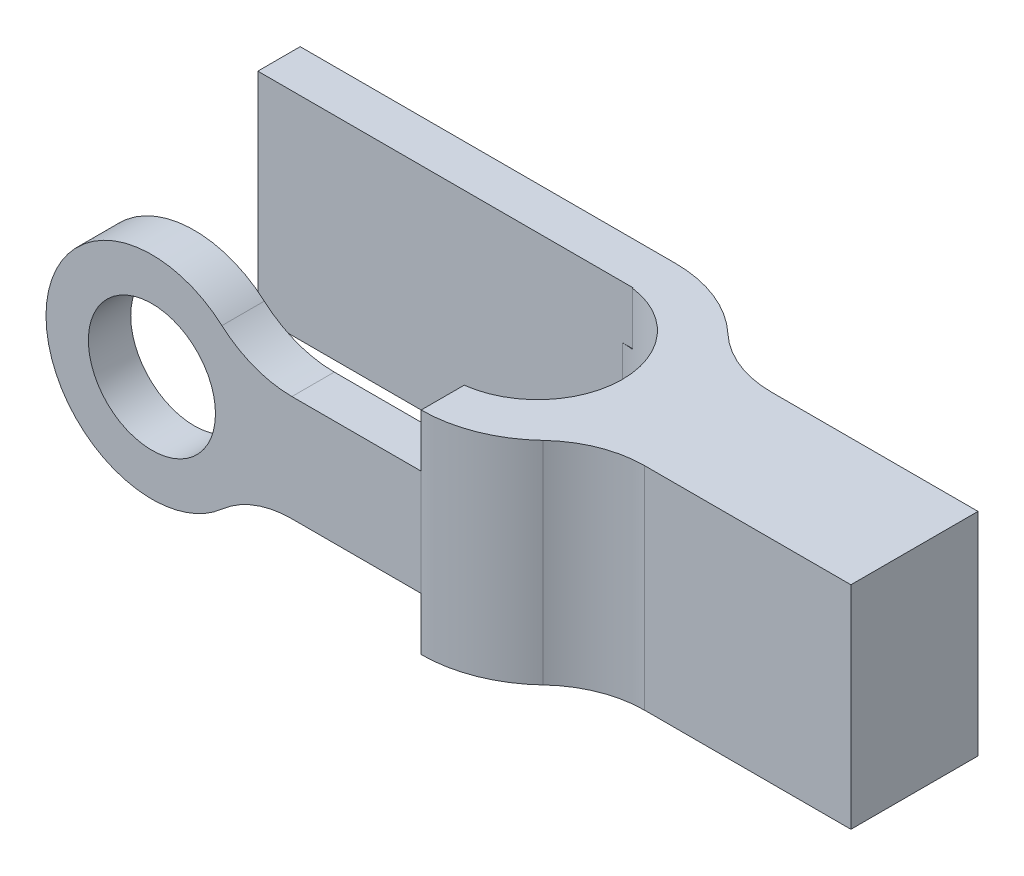
ISO-10303-21;
HEADER;
FILE_DESCRIPTION(('STEP AP214'),'2;1');
FILE_NAME('part.step','',(''),(''),'','','');
FILE_SCHEMA(('AUTOMOTIVE_DESIGN { 1 0 10303 214 1 1 1 1 }'));
ENDSEC;
DATA;
#1=APPLICATION_CONTEXT('core data for automotive mechanical design processes');
#2=APPLICATION_PROTOCOL_DEFINITION('international standard','automotive_design',2000,#1);
#3=PRODUCT_CONTEXT('',#1,'mechanical');
#4=PRODUCT('Part','Part','',(#3));
#5=PRODUCT_RELATED_PRODUCT_CATEGORY('part','',(#4));
#6=PRODUCT_DEFINITION_FORMATION('','',#4);
#7=PRODUCT_DEFINITION_CONTEXT('part definition',#1,'design');
#8=PRODUCT_DEFINITION('design','',#6,#7);
#9=PRODUCT_DEFINITION_SHAPE('','',#8);
#10=(LENGTH_UNIT() NAMED_UNIT(*) SI_UNIT(.MILLI.,.METRE.));
#11=(NAMED_UNIT(*) PLANE_ANGLE_UNIT() SI_UNIT($,.RADIAN.));
#12=(NAMED_UNIT(*) SI_UNIT($,.STERADIAN.) SOLID_ANGLE_UNIT());
#13=UNCERTAINTY_MEASURE_WITH_UNIT(LENGTH_MEASURE(1.E-05),#10,'distance_accuracy_value','');
#14=(GEOMETRIC_REPRESENTATION_CONTEXT(3) GLOBAL_UNCERTAINTY_ASSIGNED_CONTEXT((#13)) GLOBAL_UNIT_ASSIGNED_CONTEXT((#10,
#11,#12)) REPRESENTATION_CONTEXT('',''));
#15=CARTESIAN_POINT('',(0.,0.,0.));
#16=DIRECTION('',(0.,0.,1.));
#17=DIRECTION('',(1.,0.,0.));
#18=AXIS2_PLACEMENT_3D('',#15,#16,#17);
#19=CARTESIAN_POINT('',(0.,0.,0.));
#20=DIRECTION('',(0.,1.,0.));
#21=DIRECTION('',(0.,0.,1.));
#22=AXIS2_PLACEMENT_3D('',#19,#20,#21);
#23=PLANE('',#22);
#24=DIRECTION('',(0.,0.,1.));
#25=VECTOR('',#24,1.);
#26=CARTESIAN_POINT('',(-301.864744656213,0.,-100.));
#27=LINE('',#26,#25);
#28=CARTESIAN_POINT('',(-301.864744656213,0.,-20.));
#29=VERTEX_POINT('',#28);
#30=CARTESIAN_POINT('',(-301.864744656213,0.,0.));
#31=VERTEX_POINT('',#30);
#32=EDGE_CURVE('E384',#29,#31,#27,.T.);
#33=ORIENTED_EDGE('',*,*,#32,.F.);
#34=DIRECTION('',(-1.,0.,0.));
#35=VECTOR('',#34,1.);
#36=CARTESIAN_POINT('',(0.,0.,-20.));
#37=LINE('',#36,#35);
#38=CARTESIAN_POINT('',(-298.135255343787,0.,-20.));
#39=VERTEX_POINT('',#38);
#40=EDGE_CURVE('E335',#39,#29,#37,.T.);
#41=ORIENTED_EDGE('',*,*,#40,.F.);
#42=DIRECTION('',(0.,0.,1.));
#43=VECTOR('',#42,1.);
#44=CARTESIAN_POINT('',(-298.135255343787,0.,-100.));
#45=LINE('',#44,#43);
#46=CARTESIAN_POINT('',(-298.135255343787,0.,0.));
#47=VERTEX_POINT('',#46);
#48=EDGE_CURVE('E359',#39,#47,#45,.T.);
#49=ORIENTED_EDGE('',*,*,#48,.T.);
#50=DIRECTION('',(1.,0.,0.));
#51=VECTOR('',#50,1.);
#52=CARTESIAN_POINT('',(0.,0.,0.));
#53=LINE('',#52,#51);
#54=EDGE_CURVE('E589',#31,#47,#53,.T.);
#55=ORIENTED_EDGE('',*,*,#54,.F.);
#56=EDGE_LOOP('',(#33,#41,#49,#55));
#57=FACE_BOUND('',#56,.T.);
#58=ADVANCED_FACE('F144',(#57),#23,.F.);
#59=CARTESIAN_POINT('',(0.,100.,0.));
#60=DIRECTION('',(0.,0.,-1.));
#61=DIRECTION('',(-1.,0.,0.));
#62=AXIS2_PLACEMENT_3D('',#59,#60,#61);
#63=PLANE('',#62);
#64=CARTESIAN_POINT('',(-300.,49.9652272736712,0.));
#65=DIRECTION('',(0.,0.,1.));
#66=DIRECTION('',(1.,0.,0.));
#67=AXIS2_PLACEMENT_3D('',#64,#65,#66);
#68=CIRCLE('',#67,30.0000000000117);
#69=CARTESIAN_POINT('',(-269.999999999988,49.9652272736712,0.));
#70=VERTEX_POINT('',#69);
#71=EDGE_CURVE('E397',#70,#70,#68,.T.);
#72=ORIENTED_EDGE('',*,*,#71,.F.);
#73=EDGE_LOOP('',(#72));
#74=FACE_BOUND('',#73,.T.);
#75=CARTESIAN_POINT('',(-300.,49.9652272736712,0.));
#76=DIRECTION('',(0.,0.,1.));
#77=DIRECTION('',(1.,0.,0.));
#78=AXIS2_PLACEMENT_3D('',#75,#76,#77);
#79=CIRCLE('',#78,50.0000120914235);
#80=CARTESIAN_POINT('',(-266.947820204518,87.4826181732211,0.));
#81=VERTEX_POINT('',#80);
#82=CARTESIAN_POINT('',(-350.,49.9999999999793,0.));
#83=VERTEX_POINT('',#82);
#84=EDGE_CURVE('E374',#81,#83,#79,.T.);
#85=ORIENTED_EDGE('',*,*,#84,.T.);
#86=DIRECTION('',(0.,1.,0.));
#87=VECTOR('',#86,1.);
#88=CARTESIAN_POINT('',(-350.,100.,0.));
#89=LINE('',#88,#87);
#90=CARTESIAN_POINT('',(-350.,49.9304545473631,0.));
#91=VERTEX_POINT('',#90);
#92=EDGE_CURVE('E475',#91,#83,#89,.T.);
#93=ORIENTED_EDGE('',*,*,#92,.F.);
#94=CARTESIAN_POINT('',(-300.,49.9652272736712,0.));
#95=DIRECTION('',(0.,0.,1.));
#96=DIRECTION('',(1.,0.,0.));
#97=AXIS2_PLACEMENT_3D('',#94,#95,#96);
#98=CIRCLE('',#97,50.0000120914235);
#99=EDGE_CURVE('E168',#91,#31,#98,.T.);
#100=ORIENTED_EDGE('',*,*,#99,.T.);
#101=ORIENTED_EDGE('',*,*,#54,.T.);
#102=CARTESIAN_POINT('',(-300.,49.9652272736712,0.));
#103=DIRECTION('',(0.,0.,1.));
#104=DIRECTION('',(1.,0.,0.));
#105=AXIS2_PLACEMENT_3D('',#102,#103,#104);
#106=CIRCLE('',#105,50.0000120914235);
#107=CARTESIAN_POINT('',(-266.908391632648,12.4826091046546,0.));
#108=VERTEX_POINT('',#107);
#109=EDGE_CURVE('E621',#47,#108,#106,.T.);
#110=ORIENTED_EDGE('',*,*,#109,.T.);
#111=CARTESIAN_POINT('',(-233.816791267787,-25.,0.));
#112=DIRECTION('',(0.,0.,1.));
#113=DIRECTION('',(1.,0.,0.));
#114=AXIS2_PLACEMENT_3D('',#111,#112,#113);
#115=CIRCLE('',#114,50.);
#116=CARTESIAN_POINT('',(-233.816791267787,25.,0.));
#117=VERTEX_POINT('',#116);
#118=EDGE_CURVE('E624',#117,#108,#115,.T.);
#119=ORIENTED_EDGE('',*,*,#118,.F.);
#120=DIRECTION('',(-1.,0.,0.));
#121=VECTOR('',#120,1.);
#122=CARTESIAN_POINT('',(0.,25.,0.));
#123=LINE('',#122,#121);
#124=CARTESIAN_POINT('',(-172.886107130546,25.,0.));
#125=VERTEX_POINT('',#124);
#126=EDGE_CURVE('E630',#125,#117,#123,.T.);
#127=ORIENTED_EDGE('',*,*,#126,.F.);
#128=DIRECTION('',(0.,1.,0.));
#129=VECTOR('',#128,1.);
#130=CARTESIAN_POINT('',(-172.886107130546,0.,0.));
#131=LINE('',#130,#129);
#132=CARTESIAN_POINT('',(-172.886107130546,75.,0.));
#133=VERTEX_POINT('',#132);
#134=EDGE_CURVE('E505',#125,#133,#131,.T.);
#135=ORIENTED_EDGE('',*,*,#134,.T.);
#136=DIRECTION('',(-1.,0.,0.));
#137=VECTOR('',#136,1.);
#138=CARTESIAN_POINT('',(0.,75.,0.));
#139=LINE('',#138,#137);
#140=CARTESIAN_POINT('',(-233.895648401992,75.,0.));
#141=VERTEX_POINT('',#140);
#142=EDGE_CURVE('E383',#133,#141,#139,.T.);
#143=ORIENTED_EDGE('',*,*,#142,.T.);
#144=CARTESIAN_POINT('',(-233.895648401992,125.,0.));
#145=DIRECTION('',(0.,0.,1.));
#146=DIRECTION('',(1.,0.,0.));
#147=AXIS2_PLACEMENT_3D('',#144,#145,#146);
#148=CIRCLE('',#147,50.);
#149=EDGE_CURVE('E379',#141,#81,#148,.F.);
#150=ORIENTED_EDGE('',*,*,#149,.T.);
#151=EDGE_LOOP('',(#85,#93,#100,#101,#110,#119,#127,#135,#143,#150));
#152=FACE_BOUND('',#151,.T.);
#153=ADVANCED_FACE('F606',(#74,#152),#63,.F.);
#154=CARTESIAN_POINT('',(0.,0.,-20.));
#155=DIRECTION('',(0.,0.,-1.));
#156=DIRECTION('',(-1.,0.,0.));
#157=AXIS2_PLACEMENT_3D('',#154,#155,#156);
#158=PLANE('',#157);
#159=CARTESIAN_POINT('',(-300.,49.9652272736712,-20.));
#160=DIRECTION('',(0.,0.,-1.));
#161=DIRECTION('',(-1.,0.,0.));
#162=AXIS2_PLACEMENT_3D('',#159,#160,#161);
#163=CIRCLE('',#162,30.0000000000117);
#164=CARTESIAN_POINT('',(-330.000000000012,49.9652272736712,-20.));
#165=VERTEX_POINT('',#164);
#166=EDGE_CURVE('E456',#165,#165,#163,.T.);
#167=ORIENTED_EDGE('',*,*,#166,.F.);
#168=EDGE_LOOP('',(#167));
#169=FACE_BOUND('',#168,.T.);
#170=DIRECTION('',(0.,-1.,0.));
#171=VECTOR('',#170,1.);
#172=CARTESIAN_POINT('',(-350.,100.,-20.));
#173=LINE('',#172,#171);
#174=CARTESIAN_POINT('',(-350.,49.9999999999793,-20.));
#175=VERTEX_POINT('',#174);
#176=CARTESIAN_POINT('',(-350.,49.9304545473631,-20.));
#177=VERTEX_POINT('',#176);
#178=EDGE_CURVE('E471',#175,#177,#173,.T.);
#179=ORIENTED_EDGE('',*,*,#178,.F.);
#180=CARTESIAN_POINT('',(-300.,49.9652272736712,-20.));
#181=DIRECTION('',(0.,0.,-1.));
#182=DIRECTION('',(-1.,0.,0.));
#183=AXIS2_PLACEMENT_3D('',#180,#181,#182);
#184=CIRCLE('',#183,50.0000120914235);
#185=CARTESIAN_POINT('',(-266.947820204518,87.4826181732211,-20.));
#186=VERTEX_POINT('',#185);
#187=EDGE_CURVE('E421',#175,#186,#184,.T.);
#188=ORIENTED_EDGE('',*,*,#187,.T.);
#189=CARTESIAN_POINT('',(-233.895648401992,125.,-20.));
#190=DIRECTION('',(0.,0.,-1.));
#191=DIRECTION('',(-1.,0.,0.));
#192=AXIS2_PLACEMENT_3D('',#189,#190,#191);
#193=CIRCLE('',#192,50.);
#194=CARTESIAN_POINT('',(-233.895648401992,75.,-20.));
#195=VERTEX_POINT('',#194);
#196=EDGE_CURVE('E467',#186,#195,#193,.F.);
#197=ORIENTED_EDGE('',*,*,#196,.T.);
#198=DIRECTION('',(1.,0.,0.));
#199=VECTOR('',#198,1.);
#200=CARTESIAN_POINT('',(0.,75.,-20.));
#201=LINE('',#200,#199);
#202=CARTESIAN_POINT('',(-177.886107130546,75.,-20.));
#203=VERTEX_POINT('',#202);
#204=EDGE_CURVE('E440',#195,#203,#201,.T.);
#205=ORIENTED_EDGE('',*,*,#204,.T.);
#206=DIRECTION('',(0.,1.,0.));
#207=VECTOR('',#206,1.);
#208=CARTESIAN_POINT('',(-177.886107130546,0.,-20.));
#209=LINE('',#208,#207);
#210=CARTESIAN_POINT('',(-177.886107130546,25.,-20.));
#211=VERTEX_POINT('',#210);
#212=EDGE_CURVE('E577',#211,#203,#209,.T.);
#213=ORIENTED_EDGE('',*,*,#212,.F.);
#214=DIRECTION('',(1.,0.,0.));
#215=VECTOR('',#214,1.);
#216=CARTESIAN_POINT('',(0.,25.,-20.));
#217=LINE('',#216,#215);
#218=CARTESIAN_POINT('',(-233.816791267787,25.,-20.));
#219=VERTEX_POINT('',#218);
#220=EDGE_CURVE('E432',#219,#211,#217,.T.);
#221=ORIENTED_EDGE('',*,*,#220,.F.);
#222=CARTESIAN_POINT('',(-233.816791267787,-25.,-20.));
#223=DIRECTION('',(0.,0.,-1.));
#224=DIRECTION('',(-1.,0.,0.));
#225=AXIS2_PLACEMENT_3D('',#222,#223,#224);
#226=CIRCLE('',#225,50.);
#227=CARTESIAN_POINT('',(-266.908391632648,12.4826091046546,-20.));
#228=VERTEX_POINT('',#227);
#229=EDGE_CURVE('E460',#228,#219,#226,.T.);
#230=ORIENTED_EDGE('',*,*,#229,.F.);
#231=CARTESIAN_POINT('',(-300.,49.9652272736712,-20.));
#232=DIRECTION('',(0.,0.,-1.));
#233=DIRECTION('',(-1.,0.,0.));
#234=AXIS2_PLACEMENT_3D('',#231,#232,#233);
#235=CIRCLE('',#234,50.0000120914235);
#236=EDGE_CURVE('E463',#228,#39,#235,.T.);
#237=ORIENTED_EDGE('',*,*,#236,.T.);
#238=ORIENTED_EDGE('',*,*,#40,.T.);
#239=CARTESIAN_POINT('',(-300.,49.9652272736712,-20.));
#240=DIRECTION('',(0.,0.,-1.));
#241=DIRECTION('',(-1.,0.,0.));
#242=AXIS2_PLACEMENT_3D('',#239,#240,#241);
#243=CIRCLE('',#242,50.0000120914235);
#244=EDGE_CURVE('E417',#29,#177,#243,.T.);
#245=ORIENTED_EDGE('',*,*,#244,.T.);
#246=EDGE_LOOP('',(#179,#188,#197,#205,#213,#221,#230,#237,#238,#245));
#247=FACE_BOUND('',#246,.T.);
#248=ADVANCED_FACE('F614',(#169,#247),#158,.T.);
#249=CARTESIAN_POINT('',(-350.,0.,0.));
#250=DIRECTION('',(-1.,0.,0.));
#251=DIRECTION('',(0.,0.,1.));
#252=AXIS2_PLACEMENT_3D('',#249,#250,#251);
#253=PLANE('',#252);
#254=ORIENTED_EDGE('',*,*,#92,.T.);
#255=DIRECTION('',(0.,0.,1.));
#256=VECTOR('',#255,1.);
#257=CARTESIAN_POINT('',(-350.,49.9999999999793,-100.));
#258=LINE('',#257,#256);
#259=EDGE_CURVE('E12',#83,#175,#258,.F.);
#260=ORIENTED_EDGE('',*,*,#259,.T.);
#261=ORIENTED_EDGE('',*,*,#178,.T.);
#262=DIRECTION('',(0.,0.,1.));
#263=VECTOR('',#262,1.);
#264=CARTESIAN_POINT('',(-350.,49.9304545473631,-100.));
#265=LINE('',#264,#263);
#266=EDGE_CURVE('E153',#177,#91,#265,.T.);
#267=ORIENTED_EDGE('',*,*,#266,.T.);
#268=EDGE_LOOP('',(#254,#260,#261,#267));
#269=FACE_BOUND('',#268,.T.);
#270=ADVANCED_FACE('F603',(#269),#253,.T.);
#271=CARTESIAN_POINT('',(0.,100.,0.));
#272=DIRECTION('',(-1.,0.,0.));
#273=DIRECTION('',(0.,0.,1.));
#274=AXIS2_PLACEMENT_3D('',#271,#272,#273);
#275=PLANE('',#274);
#276=DIRECTION('',(0.,1.,0.));
#277=VECTOR('',#276,1.);
#278=CARTESIAN_POINT('',(0.,0.,-90.));
#279=LINE('',#278,#277);
#280=CARTESIAN_POINT('',(0.,0.,-90.));
#281=VERTEX_POINT('',#280);
#282=CARTESIAN_POINT('',(0.,100.,-90.));
#283=VERTEX_POINT('',#282);
#284=EDGE_CURVE('E559',#281,#283,#279,.T.);
#285=ORIENTED_EDGE('',*,*,#284,.T.);
#286=DIRECTION('',(0.,0.,-1.));
#287=VECTOR('',#286,1.);
#288=CARTESIAN_POINT('',(0.,100.,0.));
#289=LINE('',#288,#287);
#290=CARTESIAN_POINT('',(0.,100.,-30.));
#291=VERTEX_POINT('',#290);
#292=EDGE_CURVE('E584',#291,#283,#289,.T.);
#293=ORIENTED_EDGE('',*,*,#292,.F.);
#294=DIRECTION('',(0.,1.,0.));
#295=VECTOR('',#294,1.);
#296=CARTESIAN_POINT('',(0.,0.,-30.));
#297=LINE('',#296,#295);
#298=CARTESIAN_POINT('',(0.,0.,-30.));
#299=VERTEX_POINT('',#298);
#300=EDGE_CURVE('E525',#299,#291,#297,.T.);
#301=ORIENTED_EDGE('',*,*,#300,.F.);
#302=DIRECTION('',(0.,0.,-1.));
#303=VECTOR('',#302,1.);
#304=CARTESIAN_POINT('',(0.,0.,0.));
#305=LINE('',#304,#303);
#306=EDGE_CURVE('E581',#299,#281,#305,.T.);
#307=ORIENTED_EDGE('',*,*,#306,.T.);
#308=EDGE_LOOP('',(#285,#293,#301,#307));
#309=FACE_BOUND('',#308,.T.);
#310=ADVANCED_FACE('F146',(#309),#275,.F.);
#311=CARTESIAN_POINT('',(0.,100.,-120.));
#312=DIRECTION('',(0.,0.,1.));
#313=DIRECTION('',(1.,0.,0.));
#314=AXIS2_PLACEMENT_3D('',#311,#312,#313);
#315=PLANE('',#314);
#316=DIRECTION('',(0.,1.,0.));
#317=VECTOR('',#316,1.);
#318=CARTESIAN_POINT('',(-172.886107130546,0.,-120.));
#319=LINE('',#318,#317);
#320=CARTESIAN_POINT('',(-172.886107130546,0.,-120.));
#321=VERTEX_POINT('',#320);
#322=CARTESIAN_POINT('',(-172.886107130546,100.,-120.));
#323=VERTEX_POINT('',#322);
#324=EDGE_CURVE('E556',#321,#323,#319,.T.);
#325=ORIENTED_EDGE('',*,*,#324,.F.);
#326=DIRECTION('',(-1.,0.,0.));
#327=VECTOR('',#326,1.);
#328=CARTESIAN_POINT('',(0.,0.,-120.));
#329=LINE('',#328,#327);
#330=CARTESIAN_POINT('',(-350.,0.,-120.));
#331=VERTEX_POINT('',#330);
#332=EDGE_CURVE('E595',#321,#331,#329,.T.);
#333=ORIENTED_EDGE('',*,*,#332,.T.);
#334=DIRECTION('',(0.,-1.,0.));
#335=VECTOR('',#334,1.);
#336=CARTESIAN_POINT('',(-350.,100.,-120.));
#337=LINE('',#336,#335);
#338=CARTESIAN_POINT('',(-350.,100.,-120.));
#339=VERTEX_POINT('',#338);
#340=EDGE_CURVE('E479',#339,#331,#337,.T.);
#341=ORIENTED_EDGE('',*,*,#340,.F.);
#342=DIRECTION('',(-1.,0.,0.));
#343=VECTOR('',#342,1.);
#344=CARTESIAN_POINT('',(0.,100.,-120.));
#345=LINE('',#344,#343);
#346=EDGE_CURVE('E588',#323,#339,#345,.T.);
#347=ORIENTED_EDGE('',*,*,#346,.F.);
#348=EDGE_LOOP('',(#325,#333,#341,#347));
#349=FACE_BOUND('',#348,.T.);
#350=ADVANCED_FACE('F712',(#349),#315,.F.);
#351=CARTESIAN_POINT('',(0.,100.,0.));
#352=DIRECTION('',(0.,1.,0.));
#353=DIRECTION('',(0.,0.,1.));
#354=AXIS2_PLACEMENT_3D('',#351,#352,#353);
#355=PLANE('',#354);
#356=DIRECTION('',(0.,0.,1.));
#357=VECTOR('',#356,1.);
#358=CARTESIAN_POINT('',(-172.886107130546,100.,-100.));
#359=LINE('',#358,#357);
#360=CARTESIAN_POINT('',(-172.886107130546,100.,-20.3137303340311));
#361=VERTEX_POINT('',#360);
#362=CARTESIAN_POINT('',(-172.886107130546,100.,0.));
#363=VERTEX_POINT('',#362);
#364=EDGE_CURVE('E402',#361,#363,#359,.T.);
#365=ORIENTED_EDGE('',*,*,#364,.T.);
#366=CARTESIAN_POINT('',(-172.886107130546,100.,-60.));
#367=DIRECTION('',(0.,1.,0.));
#368=DIRECTION('',(0.,0.,1.));
#369=AXIS2_PLACEMENT_3D('',#366,#367,#368);
#370=CIRCLE('',#369,60.);
#371=CARTESIAN_POINT('',(-131.705192029069,100.,-16.3636363636364));
#372=VERTEX_POINT('',#371);
#373=EDGE_CURVE('E506',#363,#372,#370,.T.);
#374=ORIENTED_EDGE('',*,*,#373,.T.);
#375=CARTESIAN_POINT('',(-97.3877627778381,100.,20.));
#376=DIRECTION('',(0.,1.,0.));
#377=DIRECTION('',(0.,0.,1.));
#378=AXIS2_PLACEMENT_3D('',#375,#376,#377);
#379=CIRCLE('',#378,50.);
#380=CARTESIAN_POINT('',(-97.3877627778381,100.,-30.));
#381=VERTEX_POINT('',#380);
#382=EDGE_CURVE('E497',#381,#372,#379,.T.);
#383=ORIENTED_EDGE('',*,*,#382,.F.);
#384=DIRECTION('',(-1.,0.,0.));
#385=VECTOR('',#384,1.);
#386=CARTESIAN_POINT('',(0.,100.,-30.));
#387=LINE('',#386,#385);
#388=EDGE_CURVE('E510',#291,#381,#387,.T.);
#389=ORIENTED_EDGE('',*,*,#388,.F.);
#390=ORIENTED_EDGE('',*,*,#292,.T.);
#391=DIRECTION('',(-1.,0.,0.));
#392=VECTOR('',#391,1.);
#393=CARTESIAN_POINT('',(0.,100.,-90.));
#394=LINE('',#393,#392);
#395=CARTESIAN_POINT('',(-97.3877627778381,100.,-90.));
#396=VERTEX_POINT('',#395);
#397=EDGE_CURVE('E546',#283,#396,#394,.T.);
#398=ORIENTED_EDGE('',*,*,#397,.T.);
#399=CARTESIAN_POINT('',(-97.3877627778381,100.,-140.));
#400=DIRECTION('',(0.,1.,0.));
#401=DIRECTION('',(0.,0.,1.));
#402=AXIS2_PLACEMENT_3D('',#399,#400,#401);
#403=CIRCLE('',#402,50.);
#404=CARTESIAN_POINT('',(-131.705192029069,100.,-103.636363636364));
#405=VERTEX_POINT('',#404);
#406=EDGE_CURVE('E492',#396,#405,#403,.F.);
#407=ORIENTED_EDGE('',*,*,#406,.T.);
#408=CARTESIAN_POINT('',(-172.886107130546,100.,-60.));
#409=DIRECTION('',(0.,1.,0.));
#410=DIRECTION('',(0.,0.,1.));
#411=AXIS2_PLACEMENT_3D('',#408,#409,#410);
#412=CIRCLE('',#411,60.);
#413=EDGE_CURVE('E536',#405,#323,#412,.T.);
#414=ORIENTED_EDGE('',*,*,#413,.T.);
#415=ORIENTED_EDGE('',*,*,#346,.T.);
#416=DIRECTION('',(0.,0.,-1.));
#417=VECTOR('',#416,1.);
#418=CARTESIAN_POINT('',(-350.,100.,-120.));
#419=LINE('',#418,#417);
#420=CARTESIAN_POINT('',(-350.,100.,-100.));
#421=VERTEX_POINT('',#420);
#422=EDGE_CURVE('E488',#421,#339,#419,.T.);
#423=ORIENTED_EDGE('',*,*,#422,.F.);
#424=DIRECTION('',(-1.,0.,0.));
#425=VECTOR('',#424,1.);
#426=CARTESIAN_POINT('',(0.,100.,-100.));
#427=LINE('',#426,#425);
#428=CARTESIAN_POINT('',(-172.886107130546,100.,-100.));
#429=VERTEX_POINT('',#428);
#430=EDGE_CURVE('E566',#429,#421,#427,.T.);
#431=ORIENTED_EDGE('',*,*,#430,.F.);
#432=CARTESIAN_POINT('',(-172.886107130546,100.,-99.6862696659689));
#433=VERTEX_POINT('',#432);
#434=EDGE_CURVE('E398',#429,#433,#359,.T.);
#435=ORIENTED_EDGE('',*,*,#434,.T.);
#436=CARTESIAN_POINT('',(-177.886107130546,100.,-60.));
#437=DIRECTION('',(0.,1.,0.));
#438=DIRECTION('',(0.,0.,1.));
#439=AXIS2_PLACEMENT_3D('',#436,#437,#438);
#440=CIRCLE('',#439,40.);
#441=EDGE_CURVE('E521',#361,#433,#440,.T.);
#442=ORIENTED_EDGE('',*,*,#441,.F.);
#443=EDGE_LOOP('',(#365,#374,#383,#389,#390,#398,#407,#414,#415,#423,#431,#435,#442));
#444=FACE_BOUND('',#443,.T.);
#445=ADVANCED_FACE('F669',(#444),#355,.T.);
#446=CARTESIAN_POINT('',(-172.886107130546,0.,-60.));
#447=DIRECTION('',(0.,1.,0.));
#448=DIRECTION('',(0.,0.,1.));
#449=AXIS2_PLACEMENT_3D('',#446,#447,#448);
#450=CIRCLE('',#449,60.);
#451=CARTESIAN_POINT('',(-172.886107130546,0.,0.));
#452=VERTEX_POINT('',#451);
#453=CARTESIAN_POINT('',(-131.705192029069,0.,-16.3636363636364));
#454=VERTEX_POINT('',#453);
#455=EDGE_CURVE('E493',#452,#454,#450,.T.);
#456=ORIENTED_EDGE('',*,*,#455,.F.);
#457=DIRECTION('',(0.,0.,1.));
#458=VECTOR('',#457,1.);
#459=CARTESIAN_POINT('',(-172.886107130546,0.,-100.));
#460=LINE('',#459,#458);
#461=CARTESIAN_POINT('',(-172.886107130546,0.,-20.3137303340311));
#462=VERTEX_POINT('',#461);
#463=EDGE_CURVE('E354',#462,#452,#460,.T.);
#464=ORIENTED_EDGE('',*,*,#463,.F.);
#465=CARTESIAN_POINT('',(-177.886107130546,0.,-60.));
#466=DIRECTION('',(0.,1.,0.));
#467=DIRECTION('',(0.,0.,1.));
#468=AXIS2_PLACEMENT_3D('',#465,#466,#467);
#469=CIRCLE('',#468,40.);
#470=CARTESIAN_POINT('',(-172.886107130546,0.,-99.6862696659689));
#471=VERTEX_POINT('',#470);
#472=EDGE_CURVE('E336',#462,#471,#469,.T.);
#473=ORIENTED_EDGE('',*,*,#472,.T.);
#474=CARTESIAN_POINT('',(-172.886107130546,0.,-100.));
#475=VERTEX_POINT('',#474);
#476=EDGE_CURVE('E340',#475,#471,#460,.T.);
#477=ORIENTED_EDGE('',*,*,#476,.F.);
#478=DIRECTION('',(-1.,0.,0.));
#479=VECTOR('',#478,1.);
#480=CARTESIAN_POINT('',(0.,0.,-100.));
#481=LINE('',#480,#479);
#482=CARTESIAN_POINT('',(-350.,0.,-100.));
#483=VERTEX_POINT('',#482);
#484=EDGE_CURVE('E324',#475,#483,#481,.T.);
#485=ORIENTED_EDGE('',*,*,#484,.T.);
#486=DIRECTION('',(0.,0.,1.));
#487=VECTOR('',#486,1.);
#488=CARTESIAN_POINT('',(-350.,0.,-120.));
#489=LINE('',#488,#487);
#490=EDGE_CURVE('E483',#331,#483,#489,.T.);
#491=ORIENTED_EDGE('',*,*,#490,.F.);
#492=ORIENTED_EDGE('',*,*,#332,.F.);
#493=CARTESIAN_POINT('',(-172.886107130546,0.,-60.));
#494=DIRECTION('',(0.,1.,0.));
#495=DIRECTION('',(0.,0.,1.));
#496=AXIS2_PLACEMENT_3D('',#493,#494,#495);
#497=CIRCLE('',#496,60.);
#498=CARTESIAN_POINT('',(-131.705192029069,0.,-103.636363636364));
#499=VERTEX_POINT('',#498);
#500=EDGE_CURVE('E539',#499,#321,#497,.T.);
#501=ORIENTED_EDGE('',*,*,#500,.F.);
#502=CARTESIAN_POINT('',(-97.3877627778381,0.,-140.));
#503=DIRECTION('',(0.,1.,0.));
#504=DIRECTION('',(0.,0.,1.));
#505=AXIS2_PLACEMENT_3D('',#502,#503,#504);
#506=CIRCLE('',#505,50.);
#507=CARTESIAN_POINT('',(-97.3877627778381,0.,-90.));
#508=VERTEX_POINT('',#507);
#509=EDGE_CURVE('E532',#508,#499,#506,.F.);
#510=ORIENTED_EDGE('',*,*,#509,.F.);
#511=DIRECTION('',(-1.,0.,0.));
#512=VECTOR('',#511,1.);
#513=CARTESIAN_POINT('',(0.,0.,-90.));
#514=LINE('',#513,#512);
#515=EDGE_CURVE('E535',#281,#508,#514,.T.);
#516=ORIENTED_EDGE('',*,*,#515,.F.);
#517=ORIENTED_EDGE('',*,*,#306,.F.);
#518=DIRECTION('',(-1.,0.,0.));
#519=VECTOR('',#518,1.);
#520=CARTESIAN_POINT('',(0.,0.,-30.));
#521=LINE('',#520,#519);
#522=CARTESIAN_POINT('',(-97.3877627778381,0.,-30.));
#523=VERTEX_POINT('',#522);
#524=EDGE_CURVE('E496',#299,#523,#521,.T.);
#525=ORIENTED_EDGE('',*,*,#524,.T.);
#526=CARTESIAN_POINT('',(-97.3877627778381,0.,20.));
#527=DIRECTION('',(0.,1.,0.));
#528=DIRECTION('',(0.,0.,1.));
#529=AXIS2_PLACEMENT_3D('',#526,#527,#528);
#530=CIRCLE('',#529,50.);
#531=EDGE_CURVE('E501',#523,#454,#530,.T.);
#532=ORIENTED_EDGE('',*,*,#531,.T.);
#533=EDGE_LOOP('',(#456,#464,#473,#477,#485,#491,#492,#501,#510,#516,#517,#525,#532));
#534=FACE_BOUND('',#533,.T.);
#535=ADVANCED_FACE('F349',(#534),#23,.F.);
#536=CARTESIAN_POINT('',(-177.886107130546,0.,-60.));
#537=DIRECTION('',(0.,1.,0.));
#538=DIRECTION('',(0.,0.,1.));
#539=AXIS2_PLACEMENT_3D('',#536,#537,#538);
#540=CYLINDRICAL_SURFACE('',#539,40.);
#541=ORIENTED_EDGE('',*,*,#441,.T.);
#542=DIRECTION('',(0.,1.,0.));
#543=VECTOR('',#542,1.);
#544=CARTESIAN_POINT('',(-172.886107130546,0.,-99.6862696659689));
#545=LINE('',#544,#543);
#546=CARTESIAN_POINT('',(-172.886107130546,75.,-99.6862696659689));
#547=VERTEX_POINT('',#546);
#548=EDGE_CURVE('E452',#433,#547,#545,.F.);
#549=ORIENTED_EDGE('',*,*,#548,.T.);
#550=CARTESIAN_POINT('',(-177.886107130546,75.,-60.));
#551=DIRECTION('',(0.,1.,0.));
#552=DIRECTION('',(-1.,0.,0.));
#553=AXIS2_PLACEMENT_3D('',#550,#551,#552);
#554=CIRCLE('',#553,40.);
#555=CARTESIAN_POINT('',(-177.886107130546,75.,-100.));
#556=VERTEX_POINT('',#555);
#557=EDGE_CURVE('E447',#556,#547,#554,.F.);
#558=ORIENTED_EDGE('',*,*,#557,.F.);
#559=DIRECTION('',(0.,1.,0.));
#560=VECTOR('',#559,1.);
#561=CARTESIAN_POINT('',(-177.886107130546,0.,-100.));
#562=LINE('',#561,#560);
#563=CARTESIAN_POINT('',(-177.886107130546,25.,-100.));
#564=VERTEX_POINT('',#563);
#565=EDGE_CURVE('E571',#564,#556,#562,.T.);
#566=ORIENTED_EDGE('',*,*,#565,.F.);
#567=CARTESIAN_POINT('',(-177.886107130546,25.,-60.));
#568=DIRECTION('',(0.,1.,0.));
#569=DIRECTION('',(-1.,0.,0.));
#570=AXIS2_PLACEMENT_3D('',#567,#568,#569);
#571=CIRCLE('',#570,40.);
#572=CARTESIAN_POINT('',(-172.886107130546,25.,-99.6862696659689));
#573=VERTEX_POINT('',#572);
#574=EDGE_CURVE('E439',#564,#573,#571,.F.);
#575=ORIENTED_EDGE('',*,*,#574,.T.);
#576=DIRECTION('',(0.,1.,0.));
#577=VECTOR('',#576,1.);
#578=CARTESIAN_POINT('',(-172.886107130546,0.,-99.6862696659689));
#579=LINE('',#578,#577);
#580=EDGE_CURVE('E429',#573,#471,#579,.F.);
#581=ORIENTED_EDGE('',*,*,#580,.T.);
#582=ORIENTED_EDGE('',*,*,#472,.F.);
#583=DIRECTION('',(0.,1.,0.));
#584=VECTOR('',#583,1.);
#585=CARTESIAN_POINT('',(-172.886107130546,0.,-20.3137303340311));
#586=LINE('',#585,#584);
#587=CARTESIAN_POINT('',(-172.886107130546,25.,-20.3137303340311));
#588=VERTEX_POINT('',#587);
#589=EDGE_CURVE('E425',#462,#588,#586,.T.);
#590=ORIENTED_EDGE('',*,*,#589,.T.);
#591=EDGE_CURVE('E435',#588,#211,#571,.F.);
#592=ORIENTED_EDGE('',*,*,#591,.T.);
#593=ORIENTED_EDGE('',*,*,#212,.T.);
#594=CARTESIAN_POINT('',(-172.886107130546,75.,-20.3137303340311));
#595=VERTEX_POINT('',#594);
#596=EDGE_CURVE('E444',#595,#203,#554,.F.);
#597=ORIENTED_EDGE('',*,*,#596,.F.);
#598=DIRECTION('',(0.,1.,0.));
#599=VECTOR('',#598,1.);
#600=CARTESIAN_POINT('',(-172.886107130546,0.,-20.3137303340311));
#601=LINE('',#600,#599);
#602=EDGE_CURVE('E448',#595,#361,#601,.T.);
#603=ORIENTED_EDGE('',*,*,#602,.T.);
#604=EDGE_LOOP('',(#541,#549,#558,#566,#575,#581,#582,#590,#592,#593,#597,#603));
#605=FACE_BOUND('',#604,.T.);
#606=ADVANCED_FACE('F659',(#605),#540,.F.);
#607=CARTESIAN_POINT('',(0.,0.,-100.));
#608=DIRECTION('',(0.,0.,-1.));
#609=DIRECTION('',(-1.,0.,0.));
#610=AXIS2_PLACEMENT_3D('',#607,#608,#609);
#611=PLANE('',#610);
#612=DIRECTION('',(0.,1.,0.));
#613=VECTOR('',#612,1.);
#614=CARTESIAN_POINT('',(-350.,100.,-100.));
#615=LINE('',#614,#613);
#616=EDGE_CURVE('E329',#483,#421,#615,.T.);
#617=ORIENTED_EDGE('',*,*,#616,.F.);
#618=ORIENTED_EDGE('',*,*,#484,.F.);
#619=DIRECTION('',(0.,1.,0.));
#620=VECTOR('',#619,1.);
#621=CARTESIAN_POINT('',(-172.886107130546,0.,-100.));
#622=LINE('',#621,#620);
#623=CARTESIAN_POINT('',(-172.886107130546,25.,-100.));
#624=VERTEX_POINT('',#623);
#625=EDGE_CURVE('E327',#475,#624,#622,.T.);
#626=ORIENTED_EDGE('',*,*,#625,.T.);
#627=DIRECTION('',(-1.,0.,0.));
#628=VECTOR('',#627,1.);
#629=CARTESIAN_POINT('',(0.,25.,-100.));
#630=LINE('',#629,#628);
#631=EDGE_CURVE('E160',#624,#564,#630,.T.);
#632=ORIENTED_EDGE('',*,*,#631,.T.);
#633=ORIENTED_EDGE('',*,*,#565,.T.);
#634=DIRECTION('',(-1.,0.,0.));
#635=VECTOR('',#634,1.);
#636=CARTESIAN_POINT('',(0.,75.,-100.));
#637=LINE('',#636,#635);
#638=CARTESIAN_POINT('',(-172.886107130546,75.,-100.));
#639=VERTEX_POINT('',#638);
#640=EDGE_CURVE('E370',#639,#556,#637,.T.);
#641=ORIENTED_EDGE('',*,*,#640,.F.);
#642=DIRECTION('',(0.,1.,0.));
#643=VECTOR('',#642,1.);
#644=CARTESIAN_POINT('',(-172.886107130546,0.,-100.));
#645=LINE('',#644,#643);
#646=EDGE_CURVE('E373',#639,#429,#645,.T.);
#647=ORIENTED_EDGE('',*,*,#646,.T.);
#648=ORIENTED_EDGE('',*,*,#430,.T.);
#649=EDGE_LOOP('',(#617,#618,#626,#632,#633,#641,#647,#648));
#650=FACE_BOUND('',#649,.T.);
#651=ADVANCED_FACE('F326',(#650),#611,.F.);
#652=CARTESIAN_POINT('',(-172.886107130546,0.,-60.));
#653=DIRECTION('',(0.,1.,0.));
#654=DIRECTION('',(0.,0.,1.));
#655=AXIS2_PLACEMENT_3D('',#652,#653,#654);
#656=CYLINDRICAL_SURFACE('',#655,60.);
#657=ORIENTED_EDGE('',*,*,#373,.F.);
#658=DIRECTION('',(0.,1.,0.));
#659=VECTOR('',#658,1.);
#660=CARTESIAN_POINT('',(-172.886107130546,0.,0.));
#661=LINE('',#660,#659);
#662=EDGE_CURVE('E388',#133,#363,#661,.T.);
#663=ORIENTED_EDGE('',*,*,#662,.F.);
#664=ORIENTED_EDGE('',*,*,#134,.F.);
#665=EDGE_CURVE('E528',#452,#125,#131,.T.);
#666=ORIENTED_EDGE('',*,*,#665,.F.);
#667=ORIENTED_EDGE('',*,*,#455,.T.);
#668=DIRECTION('',(0.,1.,0.));
#669=VECTOR('',#668,1.);
#670=CARTESIAN_POINT('',(-131.705192029069,0.,-16.3636363636364));
#671=LINE('',#670,#669);
#672=EDGE_CURVE('E518',#454,#372,#671,.T.);
#673=ORIENTED_EDGE('',*,*,#672,.T.);
#674=EDGE_LOOP('',(#657,#663,#664,#666,#667,#673));
#675=FACE_BOUND('',#674,.T.);
#676=ADVANCED_FACE('F646',(#675),#656,.T.);
#677=CARTESIAN_POINT('',(-97.3877627778381,0.,20.));
#678=DIRECTION('',(0.,1.,0.));
#679=DIRECTION('',(0.,0.,1.));
#680=AXIS2_PLACEMENT_3D('',#677,#678,#679);
#681=CYLINDRICAL_SURFACE('',#680,50.);
#682=ORIENTED_EDGE('',*,*,#382,.T.);
#683=ORIENTED_EDGE('',*,*,#672,.F.);
#684=ORIENTED_EDGE('',*,*,#531,.F.);
#685=DIRECTION('',(0.,1.,0.));
#686=VECTOR('',#685,1.);
#687=CARTESIAN_POINT('',(-97.3877627778381,0.,-30.));
#688=LINE('',#687,#686);
#689=EDGE_CURVE('E522',#523,#381,#688,.T.);
#690=ORIENTED_EDGE('',*,*,#689,.T.);
#691=EDGE_LOOP('',(#682,#683,#684,#690));
#692=FACE_BOUND('',#691,.T.);
#693=ADVANCED_FACE('F686',(#692),#681,.F.);
#694=CARTESIAN_POINT('',(0.,0.,-30.));
#695=DIRECTION('',(0.,0.,-1.));
#696=DIRECTION('',(-1.,0.,0.));
#697=AXIS2_PLACEMENT_3D('',#694,#695,#696);
#698=PLANE('',#697);
#699=ORIENTED_EDGE('',*,*,#388,.T.);
#700=ORIENTED_EDGE('',*,*,#689,.F.);
#701=ORIENTED_EDGE('',*,*,#524,.F.);
#702=ORIENTED_EDGE('',*,*,#300,.T.);
#703=EDGE_LOOP('',(#699,#700,#701,#702));
#704=FACE_BOUND('',#703,.T.);
#705=ADVANCED_FACE('F749',(#704),#698,.F.);
#706=CARTESIAN_POINT('',(-97.3877627778381,0.,-140.));
#707=DIRECTION('',(0.,1.,0.));
#708=DIRECTION('',(0.,0.,1.));
#709=AXIS2_PLACEMENT_3D('',#706,#707,#708);
#710=CYLINDRICAL_SURFACE('',#709,50.);
#711=ORIENTED_EDGE('',*,*,#406,.F.);
#712=DIRECTION('',(0.,1.,0.));
#713=VECTOR('',#712,1.);
#714=CARTESIAN_POINT('',(-97.3877627778381,0.,-90.));
#715=LINE('',#714,#713);
#716=EDGE_CURVE('E542',#508,#396,#715,.T.);
#717=ORIENTED_EDGE('',*,*,#716,.F.);
#718=ORIENTED_EDGE('',*,*,#509,.T.);
#719=DIRECTION('',(0.,1.,0.));
#720=VECTOR('',#719,1.);
#721=CARTESIAN_POINT('',(-131.705192029069,0.,-103.636363636364));
#722=LINE('',#721,#720);
#723=EDGE_CURVE('E511',#499,#405,#722,.T.);
#724=ORIENTED_EDGE('',*,*,#723,.T.);
#725=EDGE_LOOP('',(#711,#717,#718,#724));
#726=FACE_BOUND('',#725,.T.);
#727=ADVANCED_FACE('F705',(#726),#710,.F.);
#728=CARTESIAN_POINT('',(-172.886107130546,0.,-60.));
#729=DIRECTION('',(0.,1.,0.));
#730=DIRECTION('',(0.,0.,1.));
#731=AXIS2_PLACEMENT_3D('',#728,#729,#730);
#732=CYLINDRICAL_SURFACE('',#731,60.);
#733=ORIENTED_EDGE('',*,*,#413,.F.);
#734=ORIENTED_EDGE('',*,*,#723,.F.);
#735=ORIENTED_EDGE('',*,*,#500,.T.);
#736=ORIENTED_EDGE('',*,*,#324,.T.);
#737=EDGE_LOOP('',(#733,#734,#735,#736));
#738=FACE_BOUND('',#737,.T.);
#739=ADVANCED_FACE('F707',(#738),#732,.T.);
#740=CARTESIAN_POINT('',(0.,0.,-90.));
#741=DIRECTION('',(0.,0.,-1.));
#742=DIRECTION('',(-1.,0.,0.));
#743=AXIS2_PLACEMENT_3D('',#740,#741,#742);
#744=PLANE('',#743);
#745=ORIENTED_EDGE('',*,*,#397,.F.);
#746=ORIENTED_EDGE('',*,*,#284,.F.);
#747=ORIENTED_EDGE('',*,*,#515,.T.);
#748=ORIENTED_EDGE('',*,*,#716,.T.);
#749=EDGE_LOOP('',(#745,#746,#747,#748));
#750=FACE_BOUND('',#749,.T.);
#751=ADVANCED_FACE('F697',(#750),#744,.T.);
#752=CARTESIAN_POINT('',(-350.,0.,0.));
#753=DIRECTION('',(-1.,0.,0.));
#754=DIRECTION('',(0.,0.,1.));
#755=AXIS2_PLACEMENT_3D('',#752,#753,#754);
#756=PLANE('',#755);
#757=ORIENTED_EDGE('',*,*,#340,.T.);
#758=ORIENTED_EDGE('',*,*,#490,.T.);
#759=ORIENTED_EDGE('',*,*,#616,.T.);
#760=ORIENTED_EDGE('',*,*,#422,.T.);
#761=EDGE_LOOP('',(#757,#758,#759,#760));
#762=FACE_BOUND('',#761,.T.);
#763=ADVANCED_FACE('F714',(#762),#756,.T.);
#764=CARTESIAN_POINT('',(-300.,49.9652272736712,-100.));
#765=DIRECTION('',(0.,0.,1.));
#766=DIRECTION('',(1.,0.,0.));
#767=AXIS2_PLACEMENT_3D('',#764,#765,#766);
#768=CYLINDRICAL_SURFACE('',#767,50.0000120914235);
#769=ORIENTED_EDGE('',*,*,#32,.T.);
#770=ORIENTED_EDGE('',*,*,#99,.F.);
#771=ORIENTED_EDGE('',*,*,#266,.F.);
#772=ORIENTED_EDGE('',*,*,#244,.F.);
#773=EDGE_LOOP('',(#769,#770,#771,#772));
#774=FACE_BOUND('',#773,.T.);
#775=ADVANCED_FACE('F617',(#774),#768,.T.);
#776=CARTESIAN_POINT('',(-172.886107130546,0.,-100.));
#777=DIRECTION('',(1.,0.,0.));
#778=DIRECTION('',(0.,0.,-1.));
#779=AXIS2_PLACEMENT_3D('',#776,#777,#778);
#780=PLANE('',#779);
#781=DIRECTION('',(0.,0.,1.));
#782=VECTOR('',#781,1.);
#783=CARTESIAN_POINT('',(-172.886107130546,75.,-100.));
#784=LINE('',#783,#782);
#785=EDGE_CURVE('E407',#595,#133,#784,.T.);
#786=ORIENTED_EDGE('',*,*,#785,.T.);
#787=ORIENTED_EDGE('',*,*,#662,.T.);
#788=ORIENTED_EDGE('',*,*,#364,.F.);
#789=ORIENTED_EDGE('',*,*,#602,.F.);
#790=EDGE_LOOP('',(#786,#787,#788,#789));
#791=FACE_BOUND('',#790,.T.);
#792=ADVANCED_FACE('F674',(#791),#780,.F.);
#793=CARTESIAN_POINT('',(0.,75.,-100.));
#794=DIRECTION('',(0.,1.,0.));
#795=DIRECTION('',(-1.,0.,0.));
#796=AXIS2_PLACEMENT_3D('',#793,#794,#795);
#797=PLANE('',#796);
#798=ORIENTED_EDGE('',*,*,#596,.T.);
#799=ORIENTED_EDGE('',*,*,#204,.F.);
#800=DIRECTION('',(0.,0.,1.));
#801=VECTOR('',#800,1.);
#802=CARTESIAN_POINT('',(-233.895648401992,75.,-100.));
#803=LINE('',#802,#801);
#804=EDGE_CURVE('E378',#195,#141,#803,.T.);
#805=ORIENTED_EDGE('',*,*,#804,.T.);
#806=ORIENTED_EDGE('',*,*,#142,.F.);
#807=ORIENTED_EDGE('',*,*,#785,.F.);
#808=EDGE_LOOP('',(#798,#799,#805,#806,#807));
#809=FACE_BOUND('',#808,.T.);
#810=ADVANCED_FACE('F677',(#809),#797,.T.);
#811=CARTESIAN_POINT('',(-300.,49.9652272736712,-100.));
#812=DIRECTION('',(0.,0.,1.));
#813=DIRECTION('',(1.,0.,0.));
#814=AXIS2_PLACEMENT_3D('',#811,#812,#813);
#815=CYLINDRICAL_SURFACE('',#814,50.0000120914235);
#816=ORIENTED_EDGE('',*,*,#259,.F.);
#817=ORIENTED_EDGE('',*,*,#84,.F.);
#818=DIRECTION('',(0.,0.,1.));
#819=VECTOR('',#818,1.);
#820=CARTESIAN_POINT('',(-266.947820204518,87.4826181732211,-100.));
#821=LINE('',#820,#819);
#822=EDGE_CURVE('E394',#186,#81,#821,.T.);
#823=ORIENTED_EDGE('',*,*,#822,.F.);
#824=ORIENTED_EDGE('',*,*,#187,.F.);
#825=EDGE_LOOP('',(#816,#817,#823,#824));
#826=FACE_BOUND('',#825,.T.);
#827=ADVANCED_FACE('F612',(#826),#815,.T.);
#828=CARTESIAN_POINT('',(-233.895648401992,125.,-100.));
#829=DIRECTION('',(0.,0.,1.));
#830=DIRECTION('',(1.,0.,0.));
#831=AXIS2_PLACEMENT_3D('',#828,#829,#830);
#832=CYLINDRICAL_SURFACE('',#831,50.);
#833=ORIENTED_EDGE('',*,*,#822,.T.);
#834=ORIENTED_EDGE('',*,*,#149,.F.);
#835=ORIENTED_EDGE('',*,*,#804,.F.);
#836=ORIENTED_EDGE('',*,*,#196,.F.);
#837=EDGE_LOOP('',(#833,#834,#835,#836));
#838=FACE_BOUND('',#837,.T.);
#839=ADVANCED_FACE('F680',(#838),#832,.F.);
#840=CARTESIAN_POINT('',(-233.816791267787,-25.,-100.));
#841=DIRECTION('',(0.,0.,1.));
#842=DIRECTION('',(1.,0.,0.));
#843=AXIS2_PLACEMENT_3D('',#840,#841,#842);
#844=CYLINDRICAL_SURFACE('',#843,50.);
#845=ORIENTED_EDGE('',*,*,#229,.T.);
#846=DIRECTION('',(0.,0.,1.));
#847=VECTOR('',#846,1.);
#848=CARTESIAN_POINT('',(-233.816791267787,25.,-100.));
#849=LINE('',#848,#847);
#850=EDGE_CURVE('E345',#219,#117,#849,.T.);
#851=ORIENTED_EDGE('',*,*,#850,.T.);
#852=ORIENTED_EDGE('',*,*,#118,.T.);
#853=DIRECTION('',(0.,0.,1.));
#854=VECTOR('',#853,1.);
#855=CARTESIAN_POINT('',(-266.908391632648,12.4826091046546,-100.));
#856=LINE('',#855,#854);
#857=EDGE_CURVE('E365',#228,#108,#856,.T.);
#858=ORIENTED_EDGE('',*,*,#857,.F.);
#859=EDGE_LOOP('',(#845,#851,#852,#858));
#860=FACE_BOUND('',#859,.T.);
#861=ADVANCED_FACE('F886',(#860),#844,.F.);
#862=CARTESIAN_POINT('',(-300.,49.9652272736712,-100.));
#863=DIRECTION('',(0.,0.,1.));
#864=DIRECTION('',(1.,0.,0.));
#865=AXIS2_PLACEMENT_3D('',#862,#863,#864);
#866=CYLINDRICAL_SURFACE('',#865,50.0000120914235);
#867=ORIENTED_EDGE('',*,*,#857,.T.);
#868=ORIENTED_EDGE('',*,*,#109,.F.);
#869=ORIENTED_EDGE('',*,*,#48,.F.);
#870=ORIENTED_EDGE('',*,*,#236,.F.);
#871=EDGE_LOOP('',(#867,#868,#869,#870));
#872=FACE_BOUND('',#871,.T.);
#873=ADVANCED_FACE('F895',(#872),#866,.T.);
#874=CARTESIAN_POINT('',(-172.886107130546,0.,-100.));
#875=DIRECTION('',(1.,0.,0.));
#876=DIRECTION('',(0.,0.,-1.));
#877=AXIS2_PLACEMENT_3D('',#874,#875,#876);
#878=PLANE('',#877);
#879=ORIENTED_EDGE('',*,*,#463,.T.);
#880=ORIENTED_EDGE('',*,*,#665,.T.);
#881=DIRECTION('',(0.,0.,1.));
#882=VECTOR('',#881,1.);
#883=CARTESIAN_POINT('',(-172.886107130546,25.,-100.));
#884=LINE('',#883,#882);
#885=EDGE_CURVE('E353',#588,#125,#884,.T.);
#886=ORIENTED_EDGE('',*,*,#885,.F.);
#887=ORIENTED_EDGE('',*,*,#589,.F.);
#888=EDGE_LOOP('',(#879,#880,#886,#887));
#889=FACE_BOUND('',#888,.T.);
#890=ADVANCED_FACE('F683',(#889),#878,.F.);
#891=CARTESIAN_POINT('',(0.,25.,-100.));
#892=DIRECTION('',(0.,1.,0.));
#893=DIRECTION('',(-1.,0.,0.));
#894=AXIS2_PLACEMENT_3D('',#891,#892,#893);
#895=PLANE('',#894);
#896=ORIENTED_EDGE('',*,*,#885,.T.);
#897=ORIENTED_EDGE('',*,*,#126,.T.);
#898=ORIENTED_EDGE('',*,*,#850,.F.);
#899=ORIENTED_EDGE('',*,*,#220,.T.);
#900=ORIENTED_EDGE('',*,*,#591,.F.);
#901=EDGE_LOOP('',(#896,#897,#898,#899,#900));
#902=FACE_BOUND('',#901,.T.);
#903=ADVANCED_FACE('F637',(#902),#895,.F.);
#904=CARTESIAN_POINT('',(-300.,49.9652272736712,-100.));
#905=DIRECTION('',(0.,0.,1.));
#906=DIRECTION('',(1.,0.,0.));
#907=AXIS2_PLACEMENT_3D('',#904,#905,#906);
#908=CYLINDRICAL_SURFACE('',#907,30.0000000000117);
#909=ORIENTED_EDGE('',*,*,#166,.T.);
#910=EDGE_LOOP('',(#909));
#911=FACE_BOUND('',#910,.T.);
#912=ORIENTED_EDGE('',*,*,#71,.T.);
#913=EDGE_LOOP('',(#912));
#914=FACE_BOUND('',#913,.T.);
#915=ADVANCED_FACE('F921',(#911,#914),#908,.F.);
#916=ORIENTED_EDGE('',*,*,#631,.F.);
#917=EDGE_CURVE('E343',#624,#573,#884,.T.);
#918=ORIENTED_EDGE('',*,*,#917,.T.);
#919=ORIENTED_EDGE('',*,*,#574,.F.);
#920=EDGE_LOOP('',(#916,#918,#919));
#921=FACE_BOUND('',#920,.T.);
#922=ADVANCED_FACE('F656',(#921),#895,.F.);
#923=ORIENTED_EDGE('',*,*,#917,.F.);
#924=ORIENTED_EDGE('',*,*,#625,.F.);
#925=ORIENTED_EDGE('',*,*,#476,.T.);
#926=ORIENTED_EDGE('',*,*,#580,.F.);
#927=EDGE_LOOP('',(#923,#924,#925,#926));
#928=FACE_BOUND('',#927,.T.);
#929=ADVANCED_FACE('F339',(#928),#878,.F.);
#930=ORIENTED_EDGE('',*,*,#434,.F.);
#931=ORIENTED_EDGE('',*,*,#646,.F.);
#932=EDGE_CURVE('E403',#639,#547,#784,.T.);
#933=ORIENTED_EDGE('',*,*,#932,.T.);
#934=ORIENTED_EDGE('',*,*,#548,.F.);
#935=EDGE_LOOP('',(#930,#931,#933,#934));
#936=FACE_BOUND('',#935,.T.);
#937=ADVANCED_FACE('F666',(#936),#780,.F.);
#938=ORIENTED_EDGE('',*,*,#557,.T.);
#939=ORIENTED_EDGE('',*,*,#932,.F.);
#940=ORIENTED_EDGE('',*,*,#640,.T.);
#941=EDGE_LOOP('',(#938,#939,#940));
#942=FACE_BOUND('',#941,.T.);
#943=ADVANCED_FACE('F870',(#942),#797,.T.);
#944=CLOSED_SHELL('',(#58,#153,#248,#270,#310,#350,#445,#535,#606,#651,#676,#693,#705,#727,#739,
#751,#763,#775,#792,#810,#827,#839,#861,#873,#890,#903,#915,#922,#929,#937,#943));
#945=MANIFOLD_SOLID_BREP('B2',#944);
#946=ADVANCED_BREP_SHAPE_REPRESENTATION('',(#18,#945),#14);
#947=SHAPE_DEFINITION_REPRESENTATION(#9,#946);
ENDSEC;
END-ISO-10303-21;
